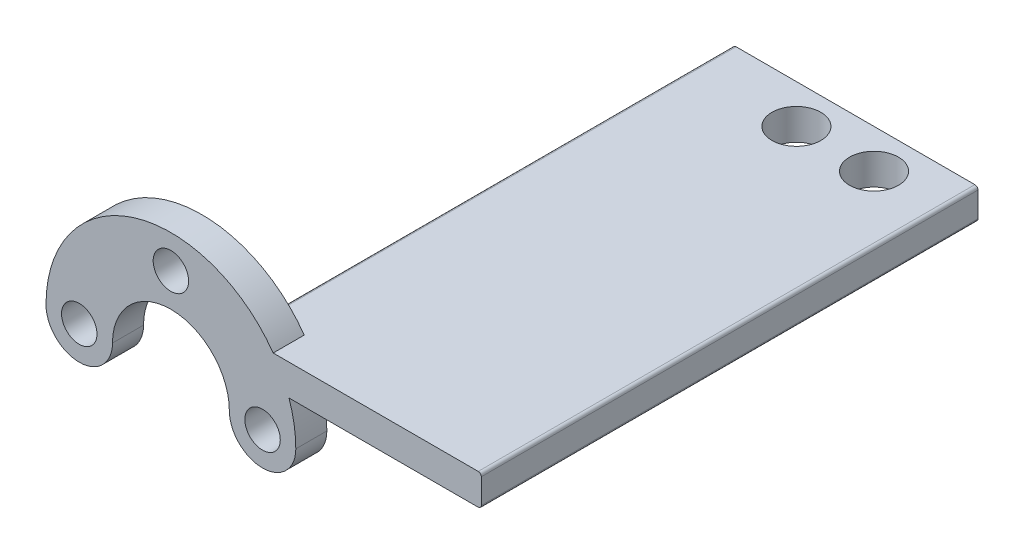
ISO-10303-21;
HEADER;
FILE_DESCRIPTION(('STEP AP214'),'2;1');
FILE_NAME('part.step','',(''),(''),'','','');
FILE_SCHEMA(('AUTOMOTIVE_DESIGN { 1 0 10303 214 1 1 1 1 }'));
ENDSEC;
DATA;
#1=APPLICATION_CONTEXT('core data for automotive mechanical design processes');
#2=APPLICATION_PROTOCOL_DEFINITION('international standard','automotive_design',2000,#1);
#3=PRODUCT_CONTEXT('',#1,'mechanical');
#4=PRODUCT('Part','Part','',(#3));
#5=PRODUCT_RELATED_PRODUCT_CATEGORY('part','',(#4));
#6=PRODUCT_DEFINITION_FORMATION('','',#4);
#7=PRODUCT_DEFINITION_CONTEXT('part definition',#1,'design');
#8=PRODUCT_DEFINITION('design','',#6,#7);
#9=PRODUCT_DEFINITION_SHAPE('','',#8);
#10=(LENGTH_UNIT() NAMED_UNIT(*) SI_UNIT(.MILLI.,.METRE.));
#11=(NAMED_UNIT(*) PLANE_ANGLE_UNIT() SI_UNIT($,.RADIAN.));
#12=(NAMED_UNIT(*) SI_UNIT($,.STERADIAN.) SOLID_ANGLE_UNIT());
#13=UNCERTAINTY_MEASURE_WITH_UNIT(LENGTH_MEASURE(1.E-05),#10,'distance_accuracy_value','');
#14=(GEOMETRIC_REPRESENTATION_CONTEXT(3) GLOBAL_UNCERTAINTY_ASSIGNED_CONTEXT((#13)) GLOBAL_UNIT_ASSIGNED_CONTEXT((#10,
#11,#12)) REPRESENTATION_CONTEXT('',''));
#15=CARTESIAN_POINT('',(0.,0.,0.));
#16=DIRECTION('',(0.,0.,1.));
#17=DIRECTION('',(1.,0.,0.));
#18=AXIS2_PLACEMENT_3D('',#15,#16,#17);
#19=CARTESIAN_POINT('',(0.,0.,0.));
#20=DIRECTION('',(0.,0.,1.));
#21=DIRECTION('',(1.,0.,0.));
#22=AXIS2_PLACEMENT_3D('',#19,#20,#21);
#23=PLANE('',#22);
#24=CARTESIAN_POINT('',(0.,7.49999999999999,0.));
#25=DIRECTION('',(0.,0.,1.));
#26=DIRECTION('',(1.,0.,0.));
#27=AXIS2_PLACEMENT_3D('',#24,#25,#26);
#28=CIRCLE('',#27,1.44999999999998);
#29=CARTESIAN_POINT('',(1.44999999999998,7.49999999999999,0.));
#30=VERTEX_POINT('',#29);
#31=EDGE_CURVE('E314',#30,#30,#28,.T.);
#32=ORIENTED_EDGE('',*,*,#31,.T.);
#33=EDGE_LOOP('',(#32));
#34=FACE_BOUND('',#33,.T.);
#35=CARTESIAN_POINT('',(7.49999999999999,0.,0.));
#36=DIRECTION('',(0.,0.,1.));
#37=DIRECTION('',(1.,0.,0.));
#38=AXIS2_PLACEMENT_3D('',#35,#36,#37);
#39=CIRCLE('',#38,1.44999999999998);
#40=CARTESIAN_POINT('',(8.94999999999998,0.,0.));
#41=VERTEX_POINT('',#40);
#42=EDGE_CURVE('E208',#41,#41,#39,.T.);
#43=ORIENTED_EDGE('',*,*,#42,.T.);
#44=EDGE_LOOP('',(#43));
#45=FACE_BOUND('',#44,.T.);
#46=CARTESIAN_POINT('',(-7.5,0.,0.));
#47=DIRECTION('',(0.,0.,1.));
#48=DIRECTION('',(1.,0.,0.));
#49=AXIS2_PLACEMENT_3D('',#46,#47,#48);
#50=CIRCLE('',#49,1.44999999999998);
#51=CARTESIAN_POINT('',(-6.05000000000002,0.,0.));
#52=VERTEX_POINT('',#51);
#53=EDGE_CURVE('E202',#52,#52,#50,.T.);
#54=ORIENTED_EDGE('',*,*,#53,.T.);
#55=EDGE_LOOP('',(#54));
#56=FACE_BOUND('',#55,.T.);
#57=DIRECTION('',(1.,0.,0.));
#58=VECTOR('',#57,1.);
#59=CARTESIAN_POINT('',(0.,5.8674,0.));
#60=LINE('',#59,#58);
#61=CARTESIAN_POINT('',(5.60696856063949,5.8674,0.));
#62=VERTEX_POINT('',#61);
#63=CARTESIAN_POINT('',(8.36791594365046,5.8674,0.));
#64=VERTEX_POINT('',#63);
#65=EDGE_CURVE('E172',#62,#64,#60,.T.);
#66=ORIENTED_EDGE('',*,*,#65,.F.);
#67=CARTESIAN_POINT('',(5.60696856063949,5.6134,0.));
#68=DIRECTION('',(0.,0.,1.));
#69=DIRECTION('',(1.,0.,0.));
#70=AXIS2_PLACEMENT_3D('',#67,#68,#69);
#71=CIRCLE('',#70,0.254);
#72=CARTESIAN_POINT('',(5.42746641614712,5.43369195865894,0.));
#73=VERTEX_POINT('',#72);
#74=EDGE_CURVE('E12',#62,#73,#71,.T.);
#75=ORIENTED_EDGE('',*,*,#74,.T.);
#76=CARTESIAN_POINT('',(0.,0.,0.));
#77=DIRECTION('',(0.,0.,1.));
#78=DIRECTION('',(1.,0.,0.));
#79=AXIS2_PLACEMENT_3D('',#76,#77,#78);
#80=CIRCLE('',#79,7.67999999999998);
#81=CARTESIAN_POINT('',(6.8530344795645,3.46674464330729,0.));
#82=VERTEX_POINT('',#81);
#83=EDGE_CURVE('E183',#82,#73,#80,.T.);
#84=ORIENTED_EDGE('',*,*,#83,.F.);
#85=CARTESIAN_POINT('',(7.07968431782093,3.5814,0.));
#86=DIRECTION('',(0.,0.,1.));
#87=DIRECTION('',(1.,0.,0.));
#88=AXIS2_PLACEMENT_3D('',#85,#86,#87);
#89=CIRCLE('',#88,0.254);
#90=CARTESIAN_POINT('',(7.07968431782093,3.3274,0.));
#91=VERTEX_POINT('',#90);
#92=EDGE_CURVE('E81',#82,#91,#89,.T.);
#93=ORIENTED_EDGE('',*,*,#92,.T.);
#94=DIRECTION('',(1.,0.,0.));
#95=VECTOR('',#94,1.);
#96=CARTESIAN_POINT('',(0.,3.3274,0.));
#97=LINE('',#96,#95);
#98=CARTESIAN_POINT('',(9.66316766076216,3.3274,0.));
#99=VERTEX_POINT('',#98);
#100=EDGE_CURVE('E280',#91,#99,#97,.T.);
#101=ORIENTED_EDGE('',*,*,#100,.T.);
#102=CARTESIAN_POINT('',(0.,0.,0.));
#103=DIRECTION('',(0.,0.,1.));
#104=DIRECTION('',(1.,0.,0.));
#105=AXIS2_PLACEMENT_3D('',#102,#103,#104);
#106=CIRCLE('',#105,10.22);
#107=CARTESIAN_POINT('',(10.22,0.,0.));
#108=VERTEX_POINT('',#107);
#109=EDGE_CURVE('E203',#108,#99,#106,.T.);
#110=ORIENTED_EDGE('',*,*,#109,.F.);
#111=CARTESIAN_POINT('',(7.49999999999999,0.,0.));
#112=DIRECTION('',(0.,0.,1.));
#113=DIRECTION('',(1.,0.,0.));
#114=AXIS2_PLACEMENT_3D('',#111,#112,#113);
#115=CIRCLE('',#114,2.71999999999998);
#116=CARTESIAN_POINT('',(4.78000000000001,0.,0.));
#117=VERTEX_POINT('',#116);
#118=EDGE_CURVE('E211',#117,#108,#115,.T.);
#119=ORIENTED_EDGE('',*,*,#118,.F.);
#120=CARTESIAN_POINT('',(0.,0.,0.));
#121=DIRECTION('',(0.,0.,1.));
#122=DIRECTION('',(1.,0.,0.));
#123=AXIS2_PLACEMENT_3D('',#120,#121,#122);
#124=CIRCLE('',#123,4.78000000000002);
#125=CARTESIAN_POINT('',(-4.78000000000002,0.,0.));
#126=VERTEX_POINT('',#125);
#127=EDGE_CURVE('E359',#117,#126,#124,.T.);
#128=ORIENTED_EDGE('',*,*,#127,.T.);
#129=CARTESIAN_POINT('',(-7.5,0.,0.));
#130=DIRECTION('',(0.,0.,1.));
#131=DIRECTION('',(1.,0.,0.));
#132=AXIS2_PLACEMENT_3D('',#129,#130,#131);
#133=CIRCLE('',#132,2.71999999999998);
#134=CARTESIAN_POINT('',(-10.22,0.,0.));
#135=VERTEX_POINT('',#134);
#136=EDGE_CURVE('E200',#135,#126,#133,.T.);
#137=ORIENTED_EDGE('',*,*,#136,.F.);
#138=CARTESIAN_POINT('',(0.,0.,0.));
#139=DIRECTION('',(0.,0.,1.));
#140=DIRECTION('',(1.,0.,0.));
#141=AXIS2_PLACEMENT_3D('',#138,#139,#140);
#142=CIRCLE('',#141,10.22);
#143=EDGE_CURVE('E189',#64,#135,#142,.T.);
#144=ORIENTED_EDGE('',*,*,#143,.F.);
#145=EDGE_LOOP('',(#66,#75,#84,#93,#101,#110,#119,#128,#137,#144));
#146=FACE_BOUND('',#145,.T.);
#147=ADVANCED_FACE('F72',(#34,#45,#56,#146),#23,.F.);
#148=CARTESIAN_POINT('',(0.,0.,2.54));
#149=DIRECTION('',(0.,0.,1.));
#150=DIRECTION('',(1.,0.,0.));
#151=AXIS2_PLACEMENT_3D('',#148,#149,#150);
#152=PLANE('',#151);
#153=CARTESIAN_POINT('',(7.49999999999999,0.,2.54));
#154=DIRECTION('',(0.,0.,1.));
#155=DIRECTION('',(1.,0.,0.));
#156=AXIS2_PLACEMENT_3D('',#153,#154,#155);
#157=CIRCLE('',#156,1.44999999999998);
#158=CARTESIAN_POINT('',(8.94999999999998,0.,2.54));
#159=VERTEX_POINT('',#158);
#160=EDGE_CURVE('E220',#159,#159,#157,.T.);
#161=ORIENTED_EDGE('',*,*,#160,.F.);
#162=EDGE_LOOP('',(#161));
#163=FACE_BOUND('',#162,.T.);
#164=CARTESIAN_POINT('',(-7.5,0.,2.54));
#165=DIRECTION('',(0.,0.,1.));
#166=DIRECTION('',(1.,0.,0.));
#167=AXIS2_PLACEMENT_3D('',#164,#165,#166);
#168=CIRCLE('',#167,1.44999999999998);
#169=CARTESIAN_POINT('',(-6.05000000000002,0.,2.54));
#170=VERTEX_POINT('',#169);
#171=EDGE_CURVE('E350',#170,#170,#168,.T.);
#172=ORIENTED_EDGE('',*,*,#171,.F.);
#173=EDGE_LOOP('',(#172));
#174=FACE_BOUND('',#173,.T.);
#175=DIRECTION('',(0.,1.,0.));
#176=VECTOR('',#175,1.);
#177=CARTESIAN_POINT('',(25.4,0.,2.54));
#178=LINE('',#177,#176);
#179=CARTESIAN_POINT('',(25.4,3.5814,2.54));
#180=VERTEX_POINT('',#179);
#181=CARTESIAN_POINT('',(25.4,5.6134,2.54));
#182=VERTEX_POINT('',#181);
#183=EDGE_CURVE('E341',#180,#182,#178,.T.);
#184=ORIENTED_EDGE('',*,*,#183,.T.);
#185=CARTESIAN_POINT('',(25.146,5.6134,2.54));
#186=DIRECTION('',(0.,0.,1.));
#187=DIRECTION('',(1.,0.,0.));
#188=AXIS2_PLACEMENT_3D('',#185,#186,#187);
#189=CIRCLE('',#188,0.254);
#190=CARTESIAN_POINT('',(25.146,5.8674,2.54));
#191=VERTEX_POINT('',#190);
#192=EDGE_CURVE('E263',#182,#191,#189,.T.);
#193=ORIENTED_EDGE('',*,*,#192,.T.);
#194=DIRECTION('',(1.,0.,0.));
#195=VECTOR('',#194,1.);
#196=CARTESIAN_POINT('',(0.,5.8674,2.54));
#197=LINE('',#196,#195);
#198=CARTESIAN_POINT('',(8.36791594365046,5.8674,2.54));
#199=VERTEX_POINT('',#198);
#200=EDGE_CURVE('E345',#199,#191,#197,.T.);
#201=ORIENTED_EDGE('',*,*,#200,.F.);
#202=CARTESIAN_POINT('',(0.,0.,2.54));
#203=DIRECTION('',(0.,0.,1.));
#204=DIRECTION('',(1.,0.,0.));
#205=AXIS2_PLACEMENT_3D('',#202,#203,#204);
#206=CIRCLE('',#205,10.22);
#207=CARTESIAN_POINT('',(-10.22,0.,2.54));
#208=VERTEX_POINT('',#207);
#209=EDGE_CURVE('E191',#199,#208,#206,.T.);
#210=ORIENTED_EDGE('',*,*,#209,.T.);
#211=CARTESIAN_POINT('',(-7.5,0.,2.54));
#212=DIRECTION('',(0.,0.,1.));
#213=DIRECTION('',(1.,0.,0.));
#214=AXIS2_PLACEMENT_3D('',#211,#212,#213);
#215=CIRCLE('',#214,2.71999999999998);
#216=CARTESIAN_POINT('',(-4.78000000000002,0.,2.54));
#217=VERTEX_POINT('',#216);
#218=EDGE_CURVE('E218',#208,#217,#215,.T.);
#219=ORIENTED_EDGE('',*,*,#218,.T.);
#220=CARTESIAN_POINT('',(0.,0.,2.54));
#221=DIRECTION('',(0.,0.,1.));
#222=DIRECTION('',(1.,0.,0.));
#223=AXIS2_PLACEMENT_3D('',#220,#221,#222);
#224=CIRCLE('',#223,4.78000000000002);
#225=CARTESIAN_POINT('',(4.78000000000001,0.,2.54));
#226=VERTEX_POINT('',#225);
#227=EDGE_CURVE('E327',#226,#217,#224,.T.);
#228=ORIENTED_EDGE('',*,*,#227,.F.);
#229=CARTESIAN_POINT('',(7.49999999999999,0.,2.54));
#230=DIRECTION('',(0.,0.,1.));
#231=DIRECTION('',(1.,0.,0.));
#232=AXIS2_PLACEMENT_3D('',#229,#230,#231);
#233=CIRCLE('',#232,2.71999999999998);
#234=CARTESIAN_POINT('',(10.22,0.,2.54));
#235=VERTEX_POINT('',#234);
#236=EDGE_CURVE('E331',#226,#235,#233,.T.);
#237=ORIENTED_EDGE('',*,*,#236,.T.);
#238=CARTESIAN_POINT('',(0.,0.,2.54));
#239=DIRECTION('',(0.,0.,1.));
#240=DIRECTION('',(1.,0.,0.));
#241=AXIS2_PLACEMENT_3D('',#238,#239,#240);
#242=CIRCLE('',#241,10.22);
#243=CARTESIAN_POINT('',(9.66316766076216,3.3274,2.54));
#244=VERTEX_POINT('',#243);
#245=EDGE_CURVE('E334',#235,#244,#242,.T.);
#246=ORIENTED_EDGE('',*,*,#245,.T.);
#247=DIRECTION('',(1.,0.,0.));
#248=VECTOR('',#247,1.);
#249=CARTESIAN_POINT('',(0.,3.3274,2.54));
#250=LINE('',#249,#248);
#251=CARTESIAN_POINT('',(25.146,3.3274,2.54));
#252=VERTEX_POINT('',#251);
#253=EDGE_CURVE('E337',#244,#252,#250,.T.);
#254=ORIENTED_EDGE('',*,*,#253,.T.);
#255=CARTESIAN_POINT('',(25.146,3.5814,2.54));
#256=DIRECTION('',(0.,0.,1.));
#257=DIRECTION('',(1.,0.,0.));
#258=AXIS2_PLACEMENT_3D('',#255,#256,#257);
#259=CIRCLE('',#258,0.254);
#260=EDGE_CURVE('E260',#252,#180,#259,.T.);
#261=ORIENTED_EDGE('',*,*,#260,.T.);
#262=EDGE_LOOP('',(#184,#193,#201,#210,#219,#228,#237,#246,#254,#261));
#263=FACE_BOUND('',#262,.T.);
#264=CARTESIAN_POINT('',(0.,7.49999999999999,2.54));
#265=DIRECTION('',(0.,0.,1.));
#266=DIRECTION('',(1.,0.,0.));
#267=AXIS2_PLACEMENT_3D('',#264,#265,#266);
#268=CIRCLE('',#267,1.44999999999998);
#269=CARTESIAN_POINT('',(1.44999999999998,7.49999999999999,2.54));
#270=VERTEX_POINT('',#269);
#271=EDGE_CURVE('E318',#270,#270,#268,.T.);
#272=ORIENTED_EDGE('',*,*,#271,.F.);
#273=EDGE_LOOP('',(#272));
#274=FACE_BOUND('',#273,.T.);
#275=ADVANCED_FACE('F372',(#163,#174,#263,#274),#152,.T.);
#276=CARTESIAN_POINT('',(-7.5,0.,2.54));
#277=DIRECTION('',(0.,0.,-1.));
#278=DIRECTION('',(-1.,0.,0.));
#279=AXIS2_PLACEMENT_3D('',#276,#277,#278);
#280=CYLINDRICAL_SURFACE('',#279,2.71999999999998);
#281=ORIENTED_EDGE('',*,*,#136,.T.);
#282=DIRECTION('',(0.,0.,-1.));
#283=VECTOR('',#282,1.);
#284=CARTESIAN_POINT('',(-4.78000000000002,0.,2.54));
#285=LINE('',#284,#283);
#286=EDGE_CURVE('E232',#217,#126,#285,.T.);
#287=ORIENTED_EDGE('',*,*,#286,.F.);
#288=ORIENTED_EDGE('',*,*,#218,.F.);
#289=DIRECTION('',(0.,0.,-1.));
#290=VECTOR('',#289,1.);
#291=CARTESIAN_POINT('',(-10.22,0.,2.54));
#292=LINE('',#291,#290);
#293=EDGE_CURVE('E195',#208,#135,#292,.T.);
#294=ORIENTED_EDGE('',*,*,#293,.T.);
#295=EDGE_LOOP('',(#281,#287,#288,#294));
#296=FACE_BOUND('',#295,.T.);
#297=ADVANCED_FACE('F381',(#296),#280,.T.);
#298=CARTESIAN_POINT('',(0.,0.,2.54));
#299=DIRECTION('',(0.,0.,-1.));
#300=DIRECTION('',(-1.,0.,0.));
#301=AXIS2_PLACEMENT_3D('',#298,#299,#300);
#302=CYLINDRICAL_SURFACE('',#301,4.78000000000002);
#303=ORIENTED_EDGE('',*,*,#127,.F.);
#304=DIRECTION('',(0.,0.,-1.));
#305=VECTOR('',#304,1.);
#306=CARTESIAN_POINT('',(4.78000000000001,0.,2.54));
#307=LINE('',#306,#305);
#308=EDGE_CURVE('E229',#226,#117,#307,.T.);
#309=ORIENTED_EDGE('',*,*,#308,.F.);
#310=ORIENTED_EDGE('',*,*,#227,.T.);
#311=ORIENTED_EDGE('',*,*,#286,.T.);
#312=EDGE_LOOP('',(#303,#309,#310,#311));
#313=FACE_BOUND('',#312,.T.);
#314=ADVANCED_FACE('F379',(#313),#302,.F.);
#315=CARTESIAN_POINT('',(7.49999999999999,0.,2.54));
#316=DIRECTION('',(0.,0.,-1.));
#317=DIRECTION('',(-1.,0.,0.));
#318=AXIS2_PLACEMENT_3D('',#315,#316,#317);
#319=CYLINDRICAL_SURFACE('',#318,2.71999999999998);
#320=ORIENTED_EDGE('',*,*,#118,.T.);
#321=DIRECTION('',(0.,0.,-1.));
#322=VECTOR('',#321,1.);
#323=CARTESIAN_POINT('',(10.22,0.,2.54));
#324=LINE('',#323,#322);
#325=EDGE_CURVE('E225',#235,#108,#324,.T.);
#326=ORIENTED_EDGE('',*,*,#325,.F.);
#327=ORIENTED_EDGE('',*,*,#236,.F.);
#328=ORIENTED_EDGE('',*,*,#308,.T.);
#329=EDGE_LOOP('',(#320,#326,#327,#328));
#330=FACE_BOUND('',#329,.T.);
#331=ADVANCED_FACE('F365',(#330),#319,.T.);
#332=CARTESIAN_POINT('',(0.,0.,2.54));
#333=DIRECTION('',(0.,0.,-1.));
#334=DIRECTION('',(-1.,0.,0.));
#335=AXIS2_PLACEMENT_3D('',#332,#333,#334);
#336=CYLINDRICAL_SURFACE('',#335,10.22);
#337=ORIENTED_EDGE('',*,*,#109,.T.);
#338=DIRECTION('',(0.,0.,-1.));
#339=VECTOR('',#338,1.);
#340=CARTESIAN_POINT('',(9.66316766076216,3.3274,2.54));
#341=LINE('',#340,#339);
#342=EDGE_CURVE('E194',#244,#99,#341,.T.);
#343=ORIENTED_EDGE('',*,*,#342,.F.);
#344=ORIENTED_EDGE('',*,*,#245,.F.);
#345=ORIENTED_EDGE('',*,*,#325,.T.);
#346=EDGE_LOOP('',(#337,#343,#344,#345));
#347=FACE_BOUND('',#346,.T.);
#348=ADVANCED_FACE('F370',(#347),#336,.T.);
#349=CARTESIAN_POINT('',(0.,3.3274,2.54));
#350=DIRECTION('',(0.,1.,0.));
#351=DIRECTION('',(-1.,0.,0.));
#352=AXIS2_PLACEMENT_3D('',#349,#350,#351);
#353=PLANE('',#352);
#354=CARTESIAN_POINT('',(20.066,3.3274,-34.925));
#355=DIRECTION('',(0.,1.,0.));
#356=DIRECTION('',(-1.,0.,0.));
#357=AXIS2_PLACEMENT_3D('',#354,#355,#356);
#358=CIRCLE('',#357,2.00025);
#359=CARTESIAN_POINT('',(18.06575,3.3274,-34.925));
#360=VERTEX_POINT('',#359);
#361=EDGE_CURVE('E184',#360,#360,#358,.T.);
#362=ORIENTED_EDGE('',*,*,#361,.T.);
#363=EDGE_LOOP('',(#362));
#364=FACE_BOUND('',#363,.T.);
#365=CARTESIAN_POINT('',(13.716,3.3274,-34.925));
#366=DIRECTION('',(0.,1.,0.));
#367=DIRECTION('',(-1.,0.,0.));
#368=AXIS2_PLACEMENT_3D('',#365,#366,#367);
#369=CIRCLE('',#368,2.00024999999999);
#370=CARTESIAN_POINT('',(11.71575,3.3274,-34.925));
#371=VERTEX_POINT('',#370);
#372=EDGE_CURVE('E719',#371,#371,#369,.T.);
#373=ORIENTED_EDGE('',*,*,#372,.T.);
#374=EDGE_LOOP('',(#373));
#375=FACE_BOUND('',#374,.T.);
#376=DIRECTION('',(1.,0.,0.));
#377=VECTOR('',#376,1.);
#378=CARTESIAN_POINT('',(0.,3.3274,-38.1));
#379=LINE('',#378,#377);
#380=CARTESIAN_POINT('',(7.07968431782093,3.3274,-38.1));
#381=VERTEX_POINT('',#380);
#382=CARTESIAN_POINT('',(25.146,3.3274,-38.1));
#383=VERTEX_POINT('',#382);
#384=EDGE_CURVE('E299',#381,#383,#379,.T.);
#385=ORIENTED_EDGE('',*,*,#384,.T.);
#386=DIRECTION('',(0.,0.,-1.));
#387=VECTOR('',#386,1.);
#388=CARTESIAN_POINT('',(25.146,3.3274,2.54));
#389=LINE('',#388,#387);
#390=EDGE_CURVE('E269',#383,#252,#389,.F.);
#391=ORIENTED_EDGE('',*,*,#390,.T.);
#392=ORIENTED_EDGE('',*,*,#253,.F.);
#393=ORIENTED_EDGE('',*,*,#342,.T.);
#394=ORIENTED_EDGE('',*,*,#100,.F.);
#395=DIRECTION('',(0.,0.,1.));
#396=VECTOR('',#395,1.);
#397=CARTESIAN_POINT('',(7.07968431782093,3.3274,2.54));
#398=LINE('',#397,#396);
#399=EDGE_CURVE('E266',#91,#381,#398,.F.);
#400=ORIENTED_EDGE('',*,*,#399,.T.);
#401=EDGE_LOOP('',(#385,#391,#392,#393,#394,#400));
#402=FACE_BOUND('',#401,.T.);
#403=ADVANCED_FACE('F283',(#364,#375,#402),#353,.F.);
#404=CARTESIAN_POINT('',(25.4,0.,2.54));
#405=DIRECTION('',(-1.,0.,0.));
#406=DIRECTION('',(0.,0.,1.));
#407=AXIS2_PLACEMENT_3D('',#404,#405,#406);
#408=PLANE('',#407);
#409=DIRECTION('',(0.,1.,0.));
#410=VECTOR('',#409,1.);
#411=CARTESIAN_POINT('',(25.4,0.,-38.1));
#412=LINE('',#411,#410);
#413=CARTESIAN_POINT('',(25.4,3.5814,-38.1));
#414=VERTEX_POINT('',#413);
#415=CARTESIAN_POINT('',(25.4,5.6134,-38.1));
#416=VERTEX_POINT('',#415);
#417=EDGE_CURVE('E307',#414,#416,#412,.T.);
#418=ORIENTED_EDGE('',*,*,#417,.T.);
#419=DIRECTION('',(0.,0.,-1.));
#420=VECTOR('',#419,1.);
#421=CARTESIAN_POINT('',(25.4,5.6134,2.54));
#422=LINE('',#421,#420);
#423=EDGE_CURVE('E257',#416,#182,#422,.F.);
#424=ORIENTED_EDGE('',*,*,#423,.T.);
#425=ORIENTED_EDGE('',*,*,#183,.F.);
#426=DIRECTION('',(0.,0.,-1.));
#427=VECTOR('',#426,1.);
#428=CARTESIAN_POINT('',(25.4,3.5814,2.54));
#429=LINE('',#428,#427);
#430=EDGE_CURVE('E253',#180,#414,#429,.T.);
#431=ORIENTED_EDGE('',*,*,#430,.T.);
#432=EDGE_LOOP('',(#418,#424,#425,#431));
#433=FACE_BOUND('',#432,.T.);
#434=ADVANCED_FACE('F413',(#433),#408,.F.);
#435=CARTESIAN_POINT('',(0.,5.8674,2.54));
#436=DIRECTION('',(0.,1.,0.));
#437=DIRECTION('',(-1.,0.,0.));
#438=AXIS2_PLACEMENT_3D('',#435,#436,#437);
#439=PLANE('',#438);
#440=CARTESIAN_POINT('',(20.066,5.8674,-34.925));
#441=DIRECTION('',(0.,1.,0.));
#442=DIRECTION('',(-1.,0.,0.));
#443=AXIS2_PLACEMENT_3D('',#440,#441,#442);
#444=CIRCLE('',#443,2.00025);
#445=CARTESIAN_POINT('',(18.06575,5.8674,-34.925));
#446=VERTEX_POINT('',#445);
#447=EDGE_CURVE('E715',#446,#446,#444,.T.);
#448=ORIENTED_EDGE('',*,*,#447,.F.);
#449=EDGE_LOOP('',(#448));
#450=FACE_BOUND('',#449,.T.);
#451=CARTESIAN_POINT('',(13.716,5.8674,-34.925));
#452=DIRECTION('',(0.,1.,0.));
#453=DIRECTION('',(-1.,0.,0.));
#454=AXIS2_PLACEMENT_3D('',#451,#452,#453);
#455=CIRCLE('',#454,2.00024999999999);
#456=CARTESIAN_POINT('',(11.71575,5.8674,-34.925));
#457=VERTEX_POINT('',#456);
#458=EDGE_CURVE('E724',#457,#457,#455,.T.);
#459=ORIENTED_EDGE('',*,*,#458,.F.);
#460=EDGE_LOOP('',(#459));
#461=FACE_BOUND('',#460,.T.);
#462=ORIENTED_EDGE('',*,*,#200,.T.);
#463=DIRECTION('',(0.,0.,-1.));
#464=VECTOR('',#463,1.);
#465=CARTESIAN_POINT('',(25.146,5.8674,-38.1));
#466=LINE('',#465,#464);
#467=CARTESIAN_POINT('',(25.146,5.8674,-38.1));
#468=VERTEX_POINT('',#467);
#469=EDGE_CURVE('E237',#191,#468,#466,.T.);
#470=ORIENTED_EDGE('',*,*,#469,.T.);
#471=DIRECTION('',(1.,0.,0.));
#472=VECTOR('',#471,1.);
#473=CARTESIAN_POINT('',(0.,5.8674,-38.1));
#474=LINE('',#473,#472);
#475=CARTESIAN_POINT('',(5.60696856063949,5.8674,-38.1));
#476=VERTEX_POINT('',#475);
#477=EDGE_CURVE('E288',#476,#468,#474,.T.);
#478=ORIENTED_EDGE('',*,*,#477,.F.);
#479=DIRECTION('',(0.,0.,-1.));
#480=VECTOR('',#479,1.);
#481=CARTESIAN_POINT('',(5.60696856063949,5.8674,0.));
#482=LINE('',#481,#480);
#483=EDGE_CURVE('E180',#476,#62,#482,.F.);
#484=ORIENTED_EDGE('',*,*,#483,.T.);
#485=ORIENTED_EDGE('',*,*,#65,.T.);
#486=DIRECTION('',(0.,0.,-1.));
#487=VECTOR('',#486,1.);
#488=CARTESIAN_POINT('',(8.36791594365046,5.8674,2.54));
#489=LINE('',#488,#487);
#490=EDGE_CURVE('E176',#199,#64,#489,.T.);
#491=ORIENTED_EDGE('',*,*,#490,.F.);
#492=EDGE_LOOP('',(#462,#470,#478,#484,#485,#491));
#493=FACE_BOUND('',#492,.T.);
#494=ADVANCED_FACE('F175',(#450,#461,#493),#439,.T.);
#495=CARTESIAN_POINT('',(-7.5,0.,2.54));
#496=DIRECTION('',(0.,0.,-1.));
#497=DIRECTION('',(-1.,0.,0.));
#498=AXIS2_PLACEMENT_3D('',#495,#496,#497);
#499=CYLINDRICAL_SURFACE('',#498,1.44999999999998);
#500=ORIENTED_EDGE('',*,*,#171,.T.);
#501=EDGE_LOOP('',(#500));
#502=FACE_BOUND('',#501,.T.);
#503=ORIENTED_EDGE('',*,*,#53,.F.);
#504=EDGE_LOOP('',(#503));
#505=FACE_BOUND('',#504,.T.);
#506=ADVANCED_FACE('F405',(#502,#505),#499,.F.);
#507=CARTESIAN_POINT('',(0.,0.,2.54));
#508=DIRECTION('',(0.,0.,-1.));
#509=DIRECTION('',(-1.,0.,0.));
#510=AXIS2_PLACEMENT_3D('',#507,#508,#509);
#511=CYLINDRICAL_SURFACE('',#510,10.22);
#512=ORIENTED_EDGE('',*,*,#143,.T.);
#513=ORIENTED_EDGE('',*,*,#293,.F.);
#514=ORIENTED_EDGE('',*,*,#209,.F.);
#515=ORIENTED_EDGE('',*,*,#490,.T.);
#516=EDGE_LOOP('',(#512,#513,#514,#515));
#517=FACE_BOUND('',#516,.T.);
#518=ADVANCED_FACE('F187',(#517),#511,.T.);
#519=CARTESIAN_POINT('',(7.49999999999999,0.,2.54));
#520=DIRECTION('',(0.,0.,-1.));
#521=DIRECTION('',(-1.,0.,0.));
#522=AXIS2_PLACEMENT_3D('',#519,#520,#521);
#523=CYLINDRICAL_SURFACE('',#522,1.44999999999998);
#524=ORIENTED_EDGE('',*,*,#160,.T.);
#525=EDGE_LOOP('',(#524));
#526=FACE_BOUND('',#525,.T.);
#527=ORIENTED_EDGE('',*,*,#42,.F.);
#528=EDGE_LOOP('',(#527));
#529=FACE_BOUND('',#528,.T.);
#530=ADVANCED_FACE('F400',(#526,#529),#523,.F.);
#531=CARTESIAN_POINT('',(0.,7.49999999999999,2.54));
#532=DIRECTION('',(0.,0.,-1.));
#533=DIRECTION('',(-1.,0.,0.));
#534=AXIS2_PLACEMENT_3D('',#531,#532,#533);
#535=CYLINDRICAL_SURFACE('',#534,1.44999999999998);
#536=ORIENTED_EDGE('',*,*,#271,.T.);
#537=EDGE_LOOP('',(#536));
#538=FACE_BOUND('',#537,.T.);
#539=ORIENTED_EDGE('',*,*,#31,.F.);
#540=EDGE_LOOP('',(#539));
#541=FACE_BOUND('',#540,.T.);
#542=ADVANCED_FACE('F403',(#538,#541),#535,.F.);
#543=CARTESIAN_POINT('',(0.,0.,-38.1));
#544=DIRECTION('',(0.,0.,1.));
#545=DIRECTION('',(1.,0.,0.));
#546=AXIS2_PLACEMENT_3D('',#543,#544,#545);
#547=CYLINDRICAL_SURFACE('',#546,7.67999999999998);
#548=CARTESIAN_POINT('',(0.,0.,-38.1));
#549=DIRECTION('',(0.,0.,1.));
#550=DIRECTION('',(1.,0.,0.));
#551=AXIS2_PLACEMENT_3D('',#548,#549,#550);
#552=CIRCLE('',#551,7.67999999999998);
#553=CARTESIAN_POINT('',(6.8530344795645,3.46674464330729,-38.1));
#554=VERTEX_POINT('',#553);
#555=CARTESIAN_POINT('',(5.42746641614712,5.43369195865894,-38.1));
#556=VERTEX_POINT('',#555);
#557=EDGE_CURVE('E297',#554,#556,#552,.T.);
#558=ORIENTED_EDGE('',*,*,#557,.F.);
#559=DIRECTION('',(0.,0.,1.));
#560=VECTOR('',#559,1.);
#561=CARTESIAN_POINT('',(6.8530344795645,3.46674464330729,-38.1));
#562=LINE('',#561,#560);
#563=EDGE_CURVE('E275',#554,#82,#562,.T.);
#564=ORIENTED_EDGE('',*,*,#563,.T.);
#565=ORIENTED_EDGE('',*,*,#83,.T.);
#566=DIRECTION('',(0.,0.,1.));
#567=VECTOR('',#566,1.);
#568=CARTESIAN_POINT('',(5.42746641614712,5.43369195865894,-38.1));
#569=LINE('',#568,#567);
#570=EDGE_CURVE('E272',#73,#556,#569,.F.);
#571=ORIENTED_EDGE('',*,*,#570,.T.);
#572=EDGE_LOOP('',(#558,#564,#565,#571));
#573=FACE_BOUND('',#572,.T.);
#574=ADVANCED_FACE('F301',(#573),#547,.F.);
#575=CARTESIAN_POINT('',(0.,0.,-38.1));
#576=DIRECTION('',(0.,0.,1.));
#577=DIRECTION('',(1.,0.,0.));
#578=AXIS2_PLACEMENT_3D('',#575,#576,#577);
#579=PLANE('',#578);
#580=ORIENTED_EDGE('',*,*,#477,.T.);
#581=CARTESIAN_POINT('',(25.146,5.6134,-38.1));
#582=DIRECTION('',(0.,0.,1.));
#583=DIRECTION('',(1.,0.,0.));
#584=AXIS2_PLACEMENT_3D('',#581,#582,#583);
#585=CIRCLE('',#584,0.254);
#586=EDGE_CURVE('E250',#468,#416,#585,.F.);
#587=ORIENTED_EDGE('',*,*,#586,.T.);
#588=ORIENTED_EDGE('',*,*,#417,.F.);
#589=CARTESIAN_POINT('',(25.146,3.5814,-38.1));
#590=DIRECTION('',(0.,0.,1.));
#591=DIRECTION('',(1.,0.,0.));
#592=AXIS2_PLACEMENT_3D('',#589,#590,#591);
#593=CIRCLE('',#592,0.254);
#594=EDGE_CURVE('E247',#414,#383,#593,.F.);
#595=ORIENTED_EDGE('',*,*,#594,.T.);
#596=ORIENTED_EDGE('',*,*,#384,.F.);
#597=CARTESIAN_POINT('',(7.07968431782093,3.5814,-38.1));
#598=DIRECTION('',(0.,0.,1.));
#599=DIRECTION('',(1.,0.,0.));
#600=AXIS2_PLACEMENT_3D('',#597,#598,#599);
#601=CIRCLE('',#600,0.254);
#602=EDGE_CURVE('E244',#381,#554,#601,.F.);
#603=ORIENTED_EDGE('',*,*,#602,.T.);
#604=ORIENTED_EDGE('',*,*,#557,.T.);
#605=CARTESIAN_POINT('',(5.60696856063949,5.6134,-38.1));
#606=DIRECTION('',(0.,0.,1.));
#607=DIRECTION('',(1.,0.,0.));
#608=AXIS2_PLACEMENT_3D('',#605,#606,#607);
#609=CIRCLE('',#608,0.254);
#610=EDGE_CURVE('E241',#556,#476,#609,.F.);
#611=ORIENTED_EDGE('',*,*,#610,.T.);
#612=EDGE_LOOP('',(#580,#587,#588,#595,#596,#603,#604,#611));
#613=FACE_BOUND('',#612,.T.);
#614=ADVANCED_FACE('F296',(#613),#579,.F.);
#615=CARTESIAN_POINT('',(25.146,5.6134,2.54));
#616=DIRECTION('',(0.,0.,1.));
#617=DIRECTION('',(1.,0.,0.));
#618=AXIS2_PLACEMENT_3D('',#615,#616,#617);
#619=CYLINDRICAL_SURFACE('',#618,0.254);
#620=ORIENTED_EDGE('',*,*,#192,.F.);
#621=ORIENTED_EDGE('',*,*,#423,.F.);
#622=ORIENTED_EDGE('',*,*,#586,.F.);
#623=ORIENTED_EDGE('',*,*,#469,.F.);
#624=EDGE_LOOP('',(#620,#621,#622,#623));
#625=FACE_BOUND('',#624,.T.);
#626=ADVANCED_FACE('F477',(#625),#619,.T.);
#627=CARTESIAN_POINT('',(25.146,3.5814,2.54));
#628=DIRECTION('',(0.,0.,-1.));
#629=DIRECTION('',(-1.,0.,0.));
#630=AXIS2_PLACEMENT_3D('',#627,#628,#629);
#631=CYLINDRICAL_SURFACE('',#630,0.254);
#632=ORIENTED_EDGE('',*,*,#260,.F.);
#633=ORIENTED_EDGE('',*,*,#390,.F.);
#634=ORIENTED_EDGE('',*,*,#594,.F.);
#635=ORIENTED_EDGE('',*,*,#430,.F.);
#636=EDGE_LOOP('',(#632,#633,#634,#635));
#637=FACE_BOUND('',#636,.T.);
#638=ADVANCED_FACE('F484',(#637),#631,.T.);
#639=CARTESIAN_POINT('',(7.07968431782093,3.5814,-38.1));
#640=DIRECTION('',(0.,0.,1.));
#641=DIRECTION('',(1.,0.,0.));
#642=AXIS2_PLACEMENT_3D('',#639,#640,#641);
#643=CYLINDRICAL_SURFACE('',#642,0.254);
#644=ORIENTED_EDGE('',*,*,#602,.F.);
#645=ORIENTED_EDGE('',*,*,#399,.F.);
#646=ORIENTED_EDGE('',*,*,#92,.F.);
#647=ORIENTED_EDGE('',*,*,#563,.F.);
#648=EDGE_LOOP('',(#644,#645,#646,#647));
#649=FACE_BOUND('',#648,.T.);
#650=ADVANCED_FACE('F291',(#649),#643,.T.);
#651=CARTESIAN_POINT('',(5.60696856063949,5.6134,-38.1));
#652=DIRECTION('',(0.,0.,1.));
#653=DIRECTION('',(1.,0.,0.));
#654=AXIS2_PLACEMENT_3D('',#651,#652,#653);
#655=CYLINDRICAL_SURFACE('',#654,0.254);
#656=ORIENTED_EDGE('',*,*,#610,.F.);
#657=ORIENTED_EDGE('',*,*,#570,.F.);
#658=ORIENTED_EDGE('',*,*,#74,.F.);
#659=ORIENTED_EDGE('',*,*,#483,.F.);
#660=EDGE_LOOP('',(#656,#657,#658,#659));
#661=FACE_BOUND('',#660,.T.);
#662=ADVANCED_FACE('F74',(#661),#655,.T.);
#663=CARTESIAN_POINT('',(13.716,-13.1826,-34.925));
#664=DIRECTION('',(0.,1.,0.));
#665=DIRECTION('',(-1.,0.,0.));
#666=AXIS2_PLACEMENT_3D('',#663,#664,#665);
#667=CYLINDRICAL_SURFACE('',#666,2.00024999999999);
#668=ORIENTED_EDGE('',*,*,#458,.T.);
#669=EDGE_LOOP('',(#668));
#670=FACE_BOUND('',#669,.T.);
#671=ORIENTED_EDGE('',*,*,#372,.F.);
#672=EDGE_LOOP('',(#671));
#673=FACE_BOUND('',#672,.T.);
#674=ADVANCED_FACE('F502',(#670,#673),#667,.F.);
#675=CARTESIAN_POINT('',(20.066,-13.1826,-34.925));
#676=DIRECTION('',(0.,1.,0.));
#677=DIRECTION('',(-1.,0.,0.));
#678=AXIS2_PLACEMENT_3D('',#675,#676,#677);
#679=CYLINDRICAL_SURFACE('',#678,2.00025);
#680=ORIENTED_EDGE('',*,*,#447,.T.);
#681=EDGE_LOOP('',(#680));
#682=FACE_BOUND('',#681,.T.);
#683=ORIENTED_EDGE('',*,*,#361,.F.);
#684=EDGE_LOOP('',(#683));
#685=FACE_BOUND('',#684,.T.);
#686=ADVANCED_FACE('F508',(#682,#685),#679,.F.);
#687=CLOSED_SHELL('',(#147,#275,#297,#314,#331,#348,#403,#434,#494,#506,#518,#530,#542,#574,
#614,#626,#638,#650,#662,#674,#686));
#688=MANIFOLD_SOLID_BREP('B2',#687);
#689=ADVANCED_BREP_SHAPE_REPRESENTATION('',(#18,#688),#14);
#690=SHAPE_DEFINITION_REPRESENTATION(#9,#689);
ENDSEC;
END-ISO-10303-21;
